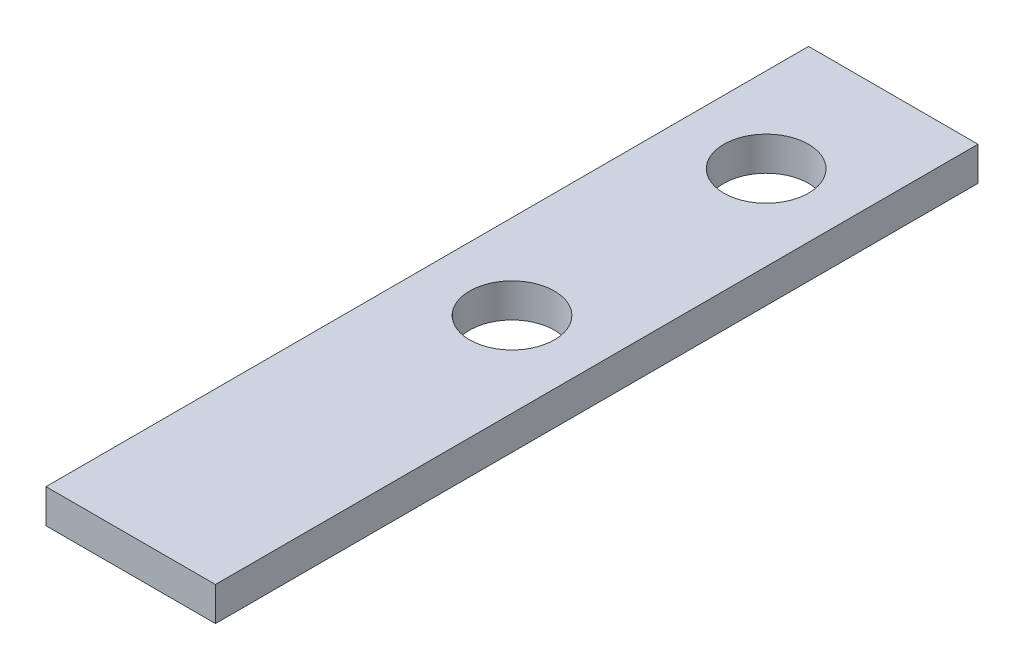
ISO-10303-21;
HEADER;
FILE_DESCRIPTION(('STEP AP214'),'2;1');
FILE_NAME('part.step','',(''),(''),'','','');
FILE_SCHEMA(('AUTOMOTIVE_DESIGN { 1 0 10303 214 1 1 1 1 }'));
ENDSEC;
DATA;
#1=APPLICATION_CONTEXT('core data for automotive mechanical design processes');
#2=APPLICATION_PROTOCOL_DEFINITION('international standard','automotive_design',2000,#1);
#3=PRODUCT_CONTEXT('',#1,'mechanical');
#4=PRODUCT('Part','Part','',(#3));
#5=PRODUCT_RELATED_PRODUCT_CATEGORY('part','',(#4));
#6=PRODUCT_DEFINITION_FORMATION('','',#4);
#7=PRODUCT_DEFINITION_CONTEXT('part definition',#1,'design');
#8=PRODUCT_DEFINITION('design','',#6,#7);
#9=PRODUCT_DEFINITION_SHAPE('','',#8);
#10=(LENGTH_UNIT() NAMED_UNIT(*) SI_UNIT(.MILLI.,.METRE.));
#11=(NAMED_UNIT(*) PLANE_ANGLE_UNIT() SI_UNIT($,.RADIAN.));
#12=(NAMED_UNIT(*) SI_UNIT($,.STERADIAN.) SOLID_ANGLE_UNIT());
#13=UNCERTAINTY_MEASURE_WITH_UNIT(LENGTH_MEASURE(1.E-05),#10,'distance_accuracy_value','');
#14=(GEOMETRIC_REPRESENTATION_CONTEXT(3) GLOBAL_UNCERTAINTY_ASSIGNED_CONTEXT((#13)) GLOBAL_UNIT_ASSIGNED_CONTEXT((#10,
#11,#12)) REPRESENTATION_CONTEXT('',''));
#15=CARTESIAN_POINT('',(0.,0.,0.));
#16=DIRECTION('',(0.,0.,1.));
#17=DIRECTION('',(1.,0.,0.));
#18=AXIS2_PLACEMENT_3D('',#15,#16,#17);
#19=CARTESIAN_POINT('',(0.,4.,0.));
#20=DIRECTION('',(0.,-1.,0.));
#21=DIRECTION('',(0.,0.,-1.));
#22=AXIS2_PLACEMENT_3D('',#19,#20,#21);
#23=PLANE('',#22);
#24=DIRECTION('',(0.,0.,1.));
#25=VECTOR('',#24,1.);
#26=CARTESIAN_POINT('',(0.,4.,0.));
#27=LINE('',#26,#25);
#28=CARTESIAN_POINT('',(0.,4.,-90.));
#29=VERTEX_POINT('',#28);
#30=CARTESIAN_POINT('',(0.,4.,0.));
#31=VERTEX_POINT('',#30);
#32=EDGE_CURVE('E95',#29,#31,#27,.T.);
#33=ORIENTED_EDGE('',*,*,#32,.T.);
#34=DIRECTION('',(1.,0.,0.));
#35=VECTOR('',#34,1.);
#36=CARTESIAN_POINT('',(0.,4.,0.));
#37=LINE('',#36,#35);
#38=CARTESIAN_POINT('',(20.,4.,0.));
#39=VERTEX_POINT('',#38);
#40=EDGE_CURVE('E82',#31,#39,#37,.T.);
#41=ORIENTED_EDGE('',*,*,#40,.T.);
#42=DIRECTION('',(0.,0.,-1.));
#43=VECTOR('',#42,1.);
#44=CARTESIAN_POINT('',(20.,4.,0.));
#45=LINE('',#44,#43);
#46=CARTESIAN_POINT('',(20.,4.,-90.));
#47=VERTEX_POINT('',#46);
#48=EDGE_CURVE('E89',#39,#47,#45,.T.);
#49=ORIENTED_EDGE('',*,*,#48,.T.);
#50=DIRECTION('',(-1.,0.,0.));
#51=VECTOR('',#50,1.);
#52=CARTESIAN_POINT('',(0.,4.,-90.));
#53=LINE('',#52,#51);
#54=EDGE_CURVE('E92',#47,#29,#53,.T.);
#55=ORIENTED_EDGE('',*,*,#54,.T.);
#56=EDGE_LOOP('',(#33,#41,#49,#55));
#57=FACE_BOUND('',#56,.T.);
#58=CARTESIAN_POINT('',(10.,4.,-45.));
#59=DIRECTION('',(0.,1.,0.));
#60=DIRECTION('',(0.,0.,1.));
#61=AXIS2_PLACEMENT_3D('',#58,#59,#60);
#62=CIRCLE('',#61,5.00000000000001);
#63=CARTESIAN_POINT('',(10.,4.,-40.));
#64=VERTEX_POINT('',#63);
#65=EDGE_CURVE('E104',#64,#64,#62,.T.);
#66=ORIENTED_EDGE('',*,*,#65,.F.);
#67=EDGE_LOOP('',(#66));
#68=FACE_BOUND('',#67,.T.);
#69=CARTESIAN_POINT('',(9.9999999999999,4.,-75.));
#70=DIRECTION('',(0.,1.,0.));
#71=DIRECTION('',(0.,0.,1.));
#72=AXIS2_PLACEMENT_3D('',#69,#70,#71);
#73=CIRCLE('',#72,5.00000000000001);
#74=CARTESIAN_POINT('',(9.9999999999999,4.,-70.));
#75=VERTEX_POINT('',#74);
#76=EDGE_CURVE('E186',#75,#75,#73,.T.);
#77=ORIENTED_EDGE('',*,*,#76,.F.);
#78=EDGE_LOOP('',(#77));
#79=FACE_BOUND('',#78,.T.);
#80=ADVANCED_FACE('F37',(#57,#68,#79),#23,.F.);
#81=CARTESIAN_POINT('',(0.,0.,0.));
#82=DIRECTION('',(0.,-1.,0.));
#83=DIRECTION('',(0.,0.,-1.));
#84=AXIS2_PLACEMENT_3D('',#81,#82,#83);
#85=PLANE('',#84);
#86=CARTESIAN_POINT('',(10.,0.,-45.));
#87=DIRECTION('',(0.,1.,0.));
#88=DIRECTION('',(0.,0.,1.));
#89=AXIS2_PLACEMENT_3D('',#86,#87,#88);
#90=CIRCLE('',#89,5.00000000000001);
#91=CARTESIAN_POINT('',(10.,0.,-40.));
#92=VERTEX_POINT('',#91);
#93=EDGE_CURVE('E191',#92,#92,#90,.T.);
#94=ORIENTED_EDGE('',*,*,#93,.T.);
#95=EDGE_LOOP('',(#94));
#96=FACE_BOUND('',#95,.T.);
#97=DIRECTION('',(0.,0.,1.));
#98=VECTOR('',#97,1.);
#99=CARTESIAN_POINT('',(0.,0.,0.));
#100=LINE('',#99,#98);
#101=CARTESIAN_POINT('',(0.,0.,-90.));
#102=VERTEX_POINT('',#101);
#103=CARTESIAN_POINT('',(0.,0.,0.));
#104=VERTEX_POINT('',#103);
#105=EDGE_CURVE('E102',#102,#104,#100,.T.);
#106=ORIENTED_EDGE('',*,*,#105,.F.);
#107=DIRECTION('',(-1.,0.,0.));
#108=VECTOR('',#107,1.);
#109=CARTESIAN_POINT('',(0.,0.,-90.));
#110=LINE('',#109,#108);
#111=CARTESIAN_POINT('',(20.,0.,-90.));
#112=VERTEX_POINT('',#111);
#113=EDGE_CURVE('E97',#112,#102,#110,.T.);
#114=ORIENTED_EDGE('',*,*,#113,.F.);
#115=DIRECTION('',(0.,0.,-1.));
#116=VECTOR('',#115,1.);
#117=CARTESIAN_POINT('',(20.,0.,0.));
#118=LINE('',#117,#116);
#119=CARTESIAN_POINT('',(20.,0.,0.));
#120=VERTEX_POINT('',#119);
#121=EDGE_CURVE('E106',#120,#112,#118,.T.);
#122=ORIENTED_EDGE('',*,*,#121,.F.);
#123=DIRECTION('',(1.,0.,0.));
#124=VECTOR('',#123,1.);
#125=CARTESIAN_POINT('',(0.,0.,0.));
#126=LINE('',#125,#124);
#127=EDGE_CURVE('E85',#104,#120,#126,.T.);
#128=ORIENTED_EDGE('',*,*,#127,.F.);
#129=EDGE_LOOP('',(#106,#114,#122,#128));
#130=FACE_BOUND('',#129,.T.);
#131=CARTESIAN_POINT('',(9.9999999999999,0.,-75.));
#132=DIRECTION('',(0.,1.,0.));
#133=DIRECTION('',(0.,0.,1.));
#134=AXIS2_PLACEMENT_3D('',#131,#132,#133);
#135=CIRCLE('',#134,5.00000000000001);
#136=CARTESIAN_POINT('',(9.9999999999999,0.,-70.));
#137=VERTEX_POINT('',#136);
#138=EDGE_CURVE('E189',#137,#137,#135,.T.);
#139=ORIENTED_EDGE('',*,*,#138,.T.);
#140=EDGE_LOOP('',(#139));
#141=FACE_BOUND('',#140,.T.);
#142=ADVANCED_FACE('F114',(#96,#130,#141),#85,.T.);
#143=CARTESIAN_POINT('',(0.,4.,0.));
#144=DIRECTION('',(1.,0.,0.));
#145=DIRECTION('',(0.,0.,-1.));
#146=AXIS2_PLACEMENT_3D('',#143,#144,#145);
#147=PLANE('',#146);
#148=ORIENTED_EDGE('',*,*,#105,.T.);
#149=DIRECTION('',(0.,-1.,0.));
#150=VECTOR('',#149,1.);
#151=CARTESIAN_POINT('',(0.,4.,0.));
#152=LINE('',#151,#150);
#153=EDGE_CURVE('E11',#31,#104,#152,.T.);
#154=ORIENTED_EDGE('',*,*,#153,.F.);
#155=ORIENTED_EDGE('',*,*,#32,.F.);
#156=DIRECTION('',(0.,-1.,0.));
#157=VECTOR('',#156,1.);
#158=CARTESIAN_POINT('',(0.,4.,-90.));
#159=LINE('',#158,#157);
#160=EDGE_CURVE('E54',#29,#102,#159,.T.);
#161=ORIENTED_EDGE('',*,*,#160,.T.);
#162=EDGE_LOOP('',(#148,#154,#155,#161));
#163=FACE_BOUND('',#162,.T.);
#164=ADVANCED_FACE('F39',(#163),#147,.F.);
#165=CARTESIAN_POINT('',(0.,4.,0.));
#166=DIRECTION('',(0.,0.,-1.));
#167=DIRECTION('',(-1.,0.,0.));
#168=AXIS2_PLACEMENT_3D('',#165,#166,#167);
#169=PLANE('',#168);
#170=ORIENTED_EDGE('',*,*,#127,.T.);
#171=DIRECTION('',(0.,-1.,0.));
#172=VECTOR('',#171,1.);
#173=CARTESIAN_POINT('',(20.,4.,0.));
#174=LINE('',#173,#172);
#175=EDGE_CURVE('E46',#39,#120,#174,.T.);
#176=ORIENTED_EDGE('',*,*,#175,.F.);
#177=ORIENTED_EDGE('',*,*,#40,.F.);
#178=ORIENTED_EDGE('',*,*,#153,.T.);
#179=EDGE_LOOP('',(#170,#176,#177,#178));
#180=FACE_BOUND('',#179,.T.);
#181=ADVANCED_FACE('F80',(#180),#169,.F.);
#182=CARTESIAN_POINT('',(20.,4.,0.));
#183=DIRECTION('',(-1.,0.,0.));
#184=DIRECTION('',(0.,0.,1.));
#185=AXIS2_PLACEMENT_3D('',#182,#183,#184);
#186=PLANE('',#185);
#187=ORIENTED_EDGE('',*,*,#121,.T.);
#188=DIRECTION('',(0.,-1.,0.));
#189=VECTOR('',#188,1.);
#190=CARTESIAN_POINT('',(20.,4.,-90.));
#191=LINE('',#190,#189);
#192=EDGE_CURVE('E67',#47,#112,#191,.T.);
#193=ORIENTED_EDGE('',*,*,#192,.F.);
#194=ORIENTED_EDGE('',*,*,#48,.F.);
#195=ORIENTED_EDGE('',*,*,#175,.T.);
#196=EDGE_LOOP('',(#187,#193,#194,#195));
#197=FACE_BOUND('',#196,.T.);
#198=ADVANCED_FACE('F90',(#197),#186,.F.);
#199=CARTESIAN_POINT('',(0.,4.,-90.));
#200=DIRECTION('',(0.,0.,1.));
#201=DIRECTION('',(1.,0.,0.));
#202=AXIS2_PLACEMENT_3D('',#199,#200,#201);
#203=PLANE('',#202);
#204=ORIENTED_EDGE('',*,*,#113,.T.);
#205=ORIENTED_EDGE('',*,*,#160,.F.);
#206=ORIENTED_EDGE('',*,*,#54,.F.);
#207=ORIENTED_EDGE('',*,*,#192,.T.);
#208=EDGE_LOOP('',(#204,#205,#206,#207));
#209=FACE_BOUND('',#208,.T.);
#210=ADVANCED_FACE('F112',(#209),#203,.F.);
#211=CARTESIAN_POINT('',(10.,4.,-45.));
#212=DIRECTION('',(0.,-1.,0.));
#213=DIRECTION('',(0.,0.,-1.));
#214=AXIS2_PLACEMENT_3D('',#211,#212,#213);
#215=CYLINDRICAL_SURFACE('',#214,5.00000000000001);
#216=ORIENTED_EDGE('',*,*,#65,.T.);
#217=EDGE_LOOP('',(#216));
#218=FACE_BOUND('',#217,.T.);
#219=ORIENTED_EDGE('',*,*,#93,.F.);
#220=EDGE_LOOP('',(#219));
#221=FACE_BOUND('',#220,.T.);
#222=ADVANCED_FACE('F128',(#218,#221),#215,.F.);
#223=CARTESIAN_POINT('',(9.9999999999999,4.,-75.));
#224=DIRECTION('',(0.,-1.,0.));
#225=DIRECTION('',(0.,0.,-1.));
#226=AXIS2_PLACEMENT_3D('',#223,#224,#225);
#227=CYLINDRICAL_SURFACE('',#226,5.00000000000001);
#228=ORIENTED_EDGE('',*,*,#76,.T.);
#229=EDGE_LOOP('',(#228));
#230=FACE_BOUND('',#229,.T.);
#231=ORIENTED_EDGE('',*,*,#138,.F.);
#232=EDGE_LOOP('',(#231));
#233=FACE_BOUND('',#232,.T.);
#234=ADVANCED_FACE('F148',(#230,#233),#227,.F.);
#235=CLOSED_SHELL('',(#80,#142,#164,#181,#198,#210,#222,#234));
#236=MANIFOLD_SOLID_BREP('B2',#235);
#237=ADVANCED_BREP_SHAPE_REPRESENTATION('',(#18,#236),#14);
#238=SHAPE_DEFINITION_REPRESENTATION(#9,#237);
ENDSEC;
END-ISO-10303-21;
